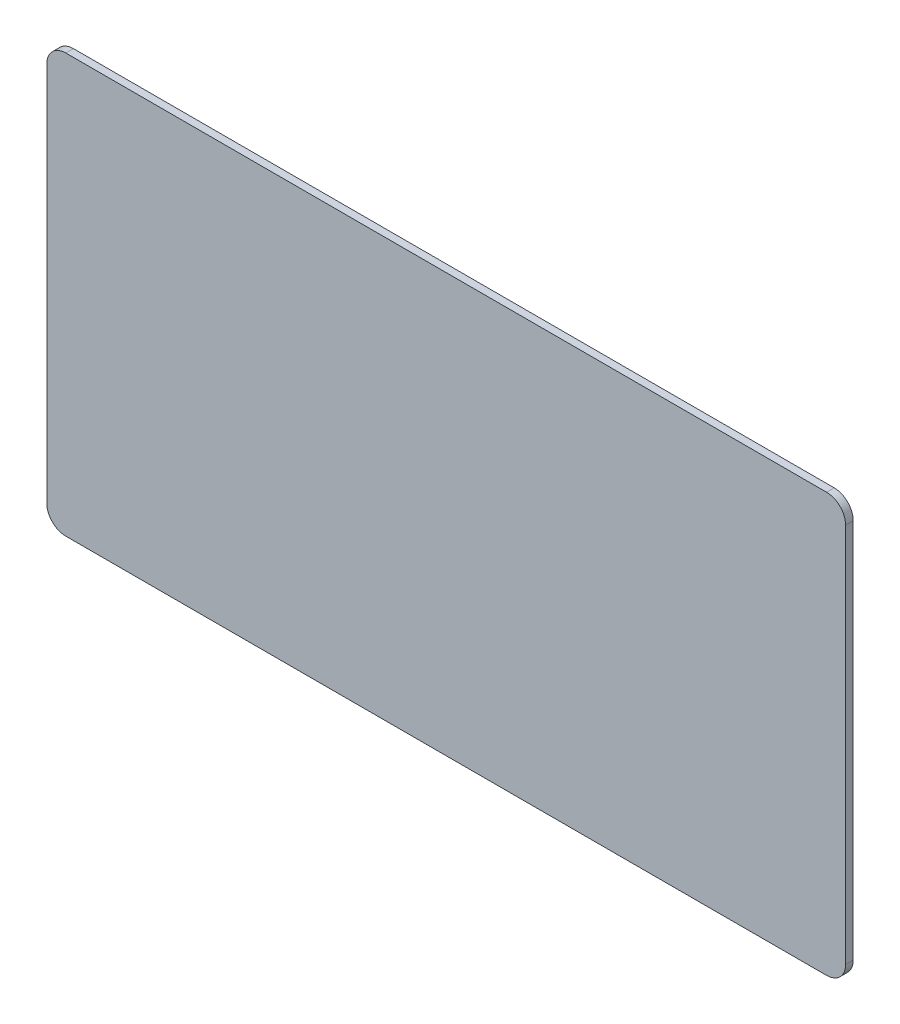
ISO-10303-21;
HEADER;
FILE_DESCRIPTION(('STEP AP214'),'2;1');
FILE_NAME('part.step','',(''),(''),'','','');
FILE_SCHEMA(('AUTOMOTIVE_DESIGN { 1 0 10303 214 1 1 1 1 }'));
ENDSEC;
DATA;
#1=APPLICATION_CONTEXT('core data for automotive mechanical design processes');
#2=APPLICATION_PROTOCOL_DEFINITION('international standard','automotive_design',2000,#1);
#3=PRODUCT_CONTEXT('',#1,'mechanical');
#4=PRODUCT('Part','Part','',(#3));
#5=PRODUCT_RELATED_PRODUCT_CATEGORY('part','',(#4));
#6=PRODUCT_DEFINITION_FORMATION('','',#4);
#7=PRODUCT_DEFINITION_CONTEXT('part definition',#1,'design');
#8=PRODUCT_DEFINITION('design','',#6,#7);
#9=PRODUCT_DEFINITION_SHAPE('','',#8);
#10=(LENGTH_UNIT() NAMED_UNIT(*) SI_UNIT(.MILLI.,.METRE.));
#11=(NAMED_UNIT(*) PLANE_ANGLE_UNIT() SI_UNIT($,.RADIAN.));
#12=(NAMED_UNIT(*) SI_UNIT($,.STERADIAN.) SOLID_ANGLE_UNIT());
#13=UNCERTAINTY_MEASURE_WITH_UNIT(LENGTH_MEASURE(1.E-05),#10,'distance_accuracy_value','');
#14=(GEOMETRIC_REPRESENTATION_CONTEXT(3) GLOBAL_UNCERTAINTY_ASSIGNED_CONTEXT((#13)) GLOBAL_UNIT_ASSIGNED_CONTEXT((#10,
#11,#12)) REPRESENTATION_CONTEXT('',''));
#15=CARTESIAN_POINT('',(0.,0.,0.));
#16=DIRECTION('',(0.,0.,1.));
#17=DIRECTION('',(1.,0.,0.));
#18=AXIS2_PLACEMENT_3D('',#15,#16,#17);
#19=CARTESIAN_POINT('',(0.,0.,0.508000000000008));
#20=DIRECTION('',(1.,0.,0.));
#21=DIRECTION('',(0.,1.00000000000001,0.));
#22=AXIS2_PLACEMENT_3D('',#19,#20,#21);
#23=PLANE('',#22);
#24=DIRECTION('',(0.,-1.00000000000001,0.));
#25=VECTOR('',#24,1.);
#26=CARTESIAN_POINT('',(0.,0.,0.508000000000008));
#27=LINE('',#26,#25);
#28=CARTESIAN_POINT('',(0.,26.67,0.507999999999981));
#29=VERTEX_POINT('',#28);
#30=CARTESIAN_POINT('',(0.,1.2699999999998,0.507999999999925));
#31=VERTEX_POINT('',#30);
#32=EDGE_CURVE('E156',#29,#31,#27,.T.);
#33=ORIENTED_EDGE('',*,*,#32,.F.);
#34=DIRECTION('',(0.,0.,-1.00000000000001));
#35=VECTOR('',#34,1.);
#36=CARTESIAN_POINT('',(0.,26.67,0.507999999999981));
#37=LINE('',#36,#35);
#38=CARTESIAN_POINT('',(0.,26.6700000000004,0.));
#39=VERTEX_POINT('',#38);
#40=EDGE_CURVE('E11',#29,#39,#37,.T.);
#41=ORIENTED_EDGE('',*,*,#40,.T.);
#42=DIRECTION('',(0.,-1.00000000000001,0.));
#43=VECTOR('',#42,1.);
#44=CARTESIAN_POINT('',(0.,0.,0.));
#45=LINE('',#44,#43);
#46=CARTESIAN_POINT('',(0.,1.26999999999999,0.));
#47=VERTEX_POINT('',#46);
#48=EDGE_CURVE('E203',#39,#47,#45,.T.);
#49=ORIENTED_EDGE('',*,*,#48,.T.);
#50=DIRECTION('',(0.,0.,-1.00000000000001));
#51=VECTOR('',#50,1.);
#52=CARTESIAN_POINT('',(0.,1.2699999999998,0.507999999999925));
#53=LINE('',#52,#51);
#54=EDGE_CURVE('E51',#47,#31,#53,.F.);
#55=ORIENTED_EDGE('',*,*,#54,.T.);
#56=EDGE_LOOP('',(#33,#41,#49,#55));
#57=FACE_BOUND('',#56,.T.);
#58=ADVANCED_FACE('F42',(#57),#23,.F.);
#59=CARTESIAN_POINT('',(0.,0.,0.508000000000008));
#60=DIRECTION('',(0.,1.00000000000001,0.));
#61=DIRECTION('',(0.,0.,1.00000000000001));
#62=AXIS2_PLACEMENT_3D('',#59,#60,#61);
#63=PLANE('',#62);
#64=DIRECTION('',(1.,0.,0.));
#65=VECTOR('',#64,1.);
#66=CARTESIAN_POINT('',(0.,0.,0.));
#67=LINE('',#66,#65);
#68=CARTESIAN_POINT('',(1.27,0.,0.));
#69=VERTEX_POINT('',#68);
#70=CARTESIAN_POINT('',(52.07,0.,0.));
#71=VERTEX_POINT('',#70);
#72=EDGE_CURVE('E165',#69,#71,#67,.T.);
#73=ORIENTED_EDGE('',*,*,#72,.T.);
#74=DIRECTION('',(0.,0.,-1.00000000000001));
#75=VECTOR('',#74,1.);
#76=CARTESIAN_POINT('',(52.07,0.,0.508000000000008));
#77=LINE('',#76,#75);
#78=CARTESIAN_POINT('',(52.07,0.,0.508000000000008));
#79=VERTEX_POINT('',#78);
#80=EDGE_CURVE('E61',#71,#79,#77,.F.);
#81=ORIENTED_EDGE('',*,*,#80,.T.);
#82=DIRECTION('',(1.,0.,0.));
#83=VECTOR('',#82,1.);
#84=CARTESIAN_POINT('',(0.,0.,0.508000000000008));
#85=LINE('',#84,#83);
#86=CARTESIAN_POINT('',(1.27,0.,0.508000000000008));
#87=VERTEX_POINT('',#86);
#88=EDGE_CURVE('E162',#87,#79,#85,.T.);
#89=ORIENTED_EDGE('',*,*,#88,.F.);
#90=DIRECTION('',(0.,0.,-1.00000000000001));
#91=VECTOR('',#90,1.);
#92=CARTESIAN_POINT('',(1.27,0.,0.508000000000008));
#93=LINE('',#92,#91);
#94=EDGE_CURVE('E192',#87,#69,#93,.T.);
#95=ORIENTED_EDGE('',*,*,#94,.T.);
#96=EDGE_LOOP('',(#73,#81,#89,#95));
#97=FACE_BOUND('',#96,.T.);
#98=ADVANCED_FACE('F210',(#97),#63,.F.);
#99=CARTESIAN_POINT('',(53.34,0.,0.507999999999981));
#100=DIRECTION('',(-1.,0.,0.));
#101=DIRECTION('',(0.,0.,1.00000000000001));
#102=AXIS2_PLACEMENT_3D('',#99,#100,#101);
#103=PLANE('',#102);
#104=DIRECTION('',(0.,1.00000000000001,0.));
#105=VECTOR('',#104,1.);
#106=CARTESIAN_POINT('',(53.34,0.,0.));
#107=LINE('',#106,#105);
#108=CARTESIAN_POINT('',(53.34,1.26999999999999,0.));
#109=VERTEX_POINT('',#108);
#110=CARTESIAN_POINT('',(53.34,26.6700000000004,0.));
#111=VERTEX_POINT('',#110);
#112=EDGE_CURVE('E157',#109,#111,#107,.T.);
#113=ORIENTED_EDGE('',*,*,#112,.T.);
#114=DIRECTION('',(0.,0.,-1.00000000000001));
#115=VECTOR('',#114,1.);
#116=CARTESIAN_POINT('',(53.34,26.67,0.508000000000036));
#117=LINE('',#116,#115);
#118=CARTESIAN_POINT('',(53.34,26.67,0.508000000000036));
#119=VERTEX_POINT('',#118);
#120=EDGE_CURVE('E131',#111,#119,#117,.F.);
#121=ORIENTED_EDGE('',*,*,#120,.T.);
#122=DIRECTION('',(0.,1.00000000000001,0.));
#123=VECTOR('',#122,1.);
#124=CARTESIAN_POINT('',(53.34,0.,0.507999999999981));
#125=LINE('',#124,#123);
#126=CARTESIAN_POINT('',(53.34,1.2699999999998,0.507999999999925));
#127=VERTEX_POINT('',#126);
#128=EDGE_CURVE('E216',#127,#119,#125,.T.);
#129=ORIENTED_EDGE('',*,*,#128,.F.);
#130=DIRECTION('',(0.,0.,-1.00000000000001));
#131=VECTOR('',#130,1.);
#132=CARTESIAN_POINT('',(53.34,1.2699999999998,0.507999999999925));
#133=LINE('',#132,#131);
#134=EDGE_CURVE('E137',#127,#109,#133,.T.);
#135=ORIENTED_EDGE('',*,*,#134,.T.);
#136=EDGE_LOOP('',(#113,#121,#129,#135));
#137=FACE_BOUND('',#136,.T.);
#138=ADVANCED_FACE('F226',(#137),#103,.F.);
#139=CARTESIAN_POINT('',(0.,27.9400000000007,0.508000000000119));
#140=DIRECTION('',(0.,-1.00000000000001,0.));
#141=DIRECTION('',(0.,0.,-1.00000000000001));
#142=AXIS2_PLACEMENT_3D('',#139,#140,#141);
#143=PLANE('',#142);
#144=DIRECTION('',(-1.,0.,0.));
#145=VECTOR('',#144,1.);
#146=CARTESIAN_POINT('',(0.,27.9400000000007,0.508000000000119));
#147=LINE('',#146,#145);
#148=CARTESIAN_POINT('',(52.07,27.9400000000006,0.508000000000147));
#149=VERTEX_POINT('',#148);
#150=CARTESIAN_POINT('',(1.26999999999999,27.9400000000007,0.508000000000119));
#151=VERTEX_POINT('',#150);
#152=EDGE_CURVE('E147',#149,#151,#147,.T.);
#153=ORIENTED_EDGE('',*,*,#152,.F.);
#154=DIRECTION('',(0.,0.,-1.00000000000001));
#155=VECTOR('',#154,1.);
#156=CARTESIAN_POINT('',(52.07,27.9400000000006,0.508000000000147));
#157=LINE('',#156,#155);
#158=CARTESIAN_POINT('',(52.07,27.94,0.));
#159=VERTEX_POINT('',#158);
#160=EDGE_CURVE('E130',#149,#159,#157,.T.);
#161=ORIENTED_EDGE('',*,*,#160,.T.);
#162=DIRECTION('',(-1.,0.,0.));
#163=VECTOR('',#162,1.);
#164=CARTESIAN_POINT('',(0.,27.9400000000004,0.));
#165=LINE('',#164,#163);
#166=CARTESIAN_POINT('',(1.26999999999999,27.9400000000004,0.));
#167=VERTEX_POINT('',#166);
#168=EDGE_CURVE('E144',#159,#167,#165,.T.);
#169=ORIENTED_EDGE('',*,*,#168,.T.);
#170=DIRECTION('',(0.,0.,-1.00000000000001));
#171=VECTOR('',#170,1.);
#172=CARTESIAN_POINT('',(1.26999999999999,27.9400000000007,0.508000000000119));
#173=LINE('',#172,#171);
#174=EDGE_CURVE('E150',#167,#151,#173,.F.);
#175=ORIENTED_EDGE('',*,*,#174,.T.);
#176=EDGE_LOOP('',(#153,#161,#169,#175));
#177=FACE_BOUND('',#176,.T.);
#178=ADVANCED_FACE('F143',(#177),#143,.F.);
#179=CARTESIAN_POINT('',(0.,27.9400000000007,0.508000000000119));
#180=DIRECTION('',(0.,0.,-1.00000000000001));
#181=DIRECTION('',(-1.,0.,0.));
#182=AXIS2_PLACEMENT_3D('',#179,#180,#181);
#183=PLANE('',#182);
#184=ORIENTED_EDGE('',*,*,#128,.T.);
#185=CARTESIAN_POINT('',(52.07,26.67,0.508000000000036));
#186=DIRECTION('',(0.,0.,-1.00000000000001));
#187=DIRECTION('',(-1.,0.,0.));
#188=AXIS2_PLACEMENT_3D('',#185,#186,#187);
#189=CIRCLE('',#188,1.27);
#190=EDGE_CURVE('E189',#119,#149,#189,.F.);
#191=ORIENTED_EDGE('',*,*,#190,.T.);
#192=ORIENTED_EDGE('',*,*,#152,.T.);
#193=CARTESIAN_POINT('',(1.26999999999999,26.67,0.507999999999981));
#194=DIRECTION('',(0.,0.,-1.00000000000001));
#195=DIRECTION('',(-1.,0.,0.));
#196=AXIS2_PLACEMENT_3D('',#193,#194,#195);
#197=CIRCLE('',#196,1.27);
#198=EDGE_CURVE('E183',#151,#29,#197,.F.);
#199=ORIENTED_EDGE('',*,*,#198,.T.);
#200=ORIENTED_EDGE('',*,*,#32,.T.);
#201=CARTESIAN_POINT('',(1.27000000000009,1.2699999999998,0.507999999999925));
#202=DIRECTION('',(0.,0.,-1.00000000000001));
#203=DIRECTION('',(-1.,0.,0.));
#204=AXIS2_PLACEMENT_3D('',#201,#202,#203);
#205=CIRCLE('',#204,1.27);
#206=EDGE_CURVE('E71',#31,#87,#205,.F.);
#207=ORIENTED_EDGE('',*,*,#206,.T.);
#208=ORIENTED_EDGE('',*,*,#88,.T.);
#209=CARTESIAN_POINT('',(52.07,1.2699999999998,0.507999999999925));
#210=DIRECTION('',(0.,0.,-1.00000000000001));
#211=DIRECTION('',(-1.,0.,0.));
#212=AXIS2_PLACEMENT_3D('',#209,#210,#211);
#213=CIRCLE('',#212,1.27);
#214=EDGE_CURVE('E186',#79,#127,#213,.F.);
#215=ORIENTED_EDGE('',*,*,#214,.T.);
#216=EDGE_LOOP('',(#184,#191,#192,#199,#200,#207,#208,#215));
#217=FACE_BOUND('',#216,.T.);
#218=ADVANCED_FACE('F206',(#217),#183,.F.);
#219=CARTESIAN_POINT('',(0.,27.9400000000004,0.));
#220=DIRECTION('',(0.,0.,-1.00000000000001));
#221=DIRECTION('',(-1.,0.,0.));
#222=AXIS2_PLACEMENT_3D('',#219,#220,#221);
#223=PLANE('',#222);
#224=ORIENTED_EDGE('',*,*,#168,.F.);
#225=CARTESIAN_POINT('',(52.07,26.6700000000004,0.));
#226=DIRECTION('',(0.,0.,-1.00000000000001));
#227=DIRECTION('',(-1.,0.,0.));
#228=AXIS2_PLACEMENT_3D('',#225,#226,#227);
#229=CIRCLE('',#228,1.27);
#230=EDGE_CURVE('E126',#159,#111,#229,.T.);
#231=ORIENTED_EDGE('',*,*,#230,.T.);
#232=ORIENTED_EDGE('',*,*,#112,.F.);
#233=CARTESIAN_POINT('',(52.07,1.26999999999999,0.));
#234=DIRECTION('',(0.,0.,-1.00000000000001));
#235=DIRECTION('',(-1.,0.,0.));
#236=AXIS2_PLACEMENT_3D('',#233,#234,#235);
#237=CIRCLE('',#236,1.27);
#238=EDGE_CURVE('E138',#109,#71,#237,.T.);
#239=ORIENTED_EDGE('',*,*,#238,.T.);
#240=ORIENTED_EDGE('',*,*,#72,.F.);
#241=CARTESIAN_POINT('',(1.27000000000009,1.26999999999999,0.));
#242=DIRECTION('',(0.,0.,-1.00000000000001));
#243=DIRECTION('',(-1.,0.,0.));
#244=AXIS2_PLACEMENT_3D('',#241,#242,#243);
#245=CIRCLE('',#244,1.27);
#246=EDGE_CURVE('E149',#69,#47,#245,.T.);
#247=ORIENTED_EDGE('',*,*,#246,.T.);
#248=ORIENTED_EDGE('',*,*,#48,.F.);
#249=CARTESIAN_POINT('',(1.26999999999999,26.6700000000004,0.));
#250=DIRECTION('',(0.,0.,-1.00000000000001));
#251=DIRECTION('',(-1.,0.,0.));
#252=AXIS2_PLACEMENT_3D('',#249,#250,#251);
#253=CIRCLE('',#252,1.27);
#254=EDGE_CURVE('E154',#39,#167,#253,.T.);
#255=ORIENTED_EDGE('',*,*,#254,.T.);
#256=EDGE_LOOP('',(#224,#231,#232,#239,#240,#247,#248,#255));
#257=FACE_BOUND('',#256,.T.);
#258=ADVANCED_FACE('F152',(#257),#223,.T.);
#259=CARTESIAN_POINT('',(52.07,26.67,0.508000000000036));
#260=DIRECTION('',(0.,0.,-1.00000000000001));
#261=DIRECTION('',(-1.,0.,0.));
#262=AXIS2_PLACEMENT_3D('',#259,#260,#261);
#263=CYLINDRICAL_SURFACE('',#262,1.27);
#264=ORIENTED_EDGE('',*,*,#190,.F.);
#265=ORIENTED_EDGE('',*,*,#120,.F.);
#266=ORIENTED_EDGE('',*,*,#230,.F.);
#267=ORIENTED_EDGE('',*,*,#160,.F.);
#268=EDGE_LOOP('',(#264,#265,#266,#267));
#269=FACE_BOUND('',#268,.T.);
#270=ADVANCED_FACE('F129',(#269),#263,.T.);
#271=CARTESIAN_POINT('',(52.07,1.2699999999998,0.507999999999925));
#272=DIRECTION('',(0.,0.,-1.00000000000001));
#273=DIRECTION('',(-1.,0.,0.));
#274=AXIS2_PLACEMENT_3D('',#271,#272,#273);
#275=CYLINDRICAL_SURFACE('',#274,1.27);
#276=ORIENTED_EDGE('',*,*,#214,.F.);
#277=ORIENTED_EDGE('',*,*,#80,.F.);
#278=ORIENTED_EDGE('',*,*,#238,.F.);
#279=ORIENTED_EDGE('',*,*,#134,.F.);
#280=EDGE_LOOP('',(#276,#277,#278,#279));
#281=FACE_BOUND('',#280,.T.);
#282=ADVANCED_FACE('F224',(#281),#275,.T.);
#283=CARTESIAN_POINT('',(1.26999999999999,26.67,0.507999999999981));
#284=DIRECTION('',(0.,0.,-1.00000000000001));
#285=DIRECTION('',(-1.,0.,0.));
#286=AXIS2_PLACEMENT_3D('',#283,#284,#285);
#287=CYLINDRICAL_SURFACE('',#286,1.27);
#288=ORIENTED_EDGE('',*,*,#198,.F.);
#289=ORIENTED_EDGE('',*,*,#174,.F.);
#290=ORIENTED_EDGE('',*,*,#254,.F.);
#291=ORIENTED_EDGE('',*,*,#40,.F.);
#292=EDGE_LOOP('',(#288,#289,#290,#291));
#293=FACE_BOUND('',#292,.T.);
#294=ADVANCED_FACE('F228',(#293),#287,.T.);
#295=CARTESIAN_POINT('',(1.27000000000009,1.2699999999998,0.507999999999925));
#296=DIRECTION('',(0.,0.,-1.00000000000001));
#297=DIRECTION('',(-1.,0.,0.));
#298=AXIS2_PLACEMENT_3D('',#295,#296,#297);
#299=CYLINDRICAL_SURFACE('',#298,1.27);
#300=ORIENTED_EDGE('',*,*,#206,.F.);
#301=ORIENTED_EDGE('',*,*,#54,.F.);
#302=ORIENTED_EDGE('',*,*,#246,.F.);
#303=ORIENTED_EDGE('',*,*,#94,.F.);
#304=EDGE_LOOP('',(#300,#301,#302,#303));
#305=FACE_BOUND('',#304,.T.);
#306=ADVANCED_FACE('F44',(#305),#299,.T.);
#307=CLOSED_SHELL('',(#58,#98,#138,#178,#218,#258,#270,#282,#294,#306));
#308=MANIFOLD_SOLID_BREP('B2',#307);
#309=ADVANCED_BREP_SHAPE_REPRESENTATION('',(#18,#308),#14);
#310=SHAPE_DEFINITION_REPRESENTATION(#9,#309);
ENDSEC;
END-ISO-10303-21;
